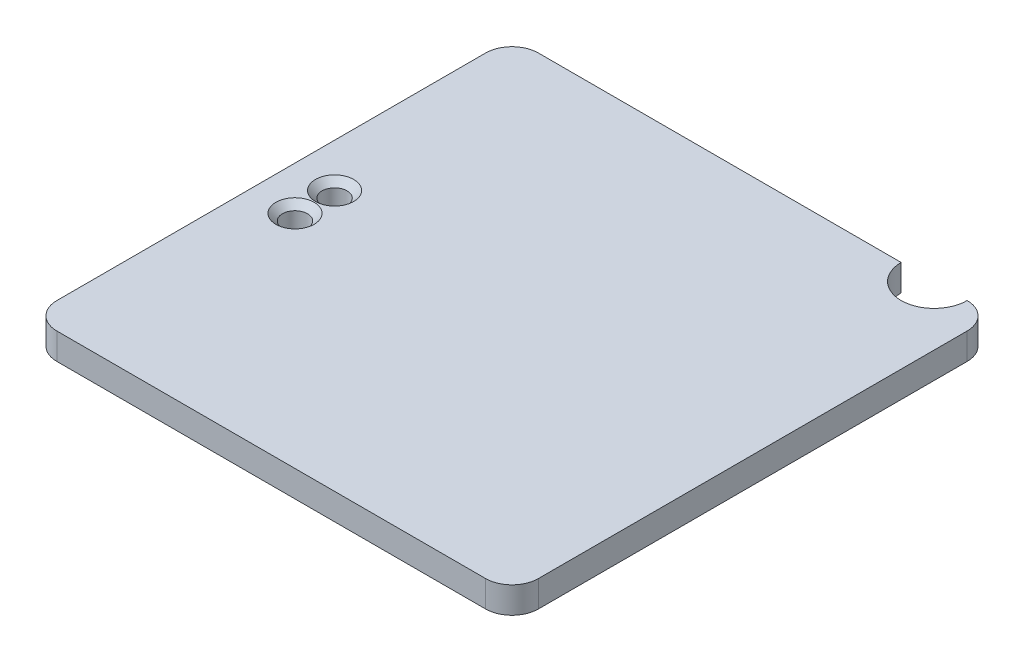
ISO-10303-21;
HEADER;
FILE_DESCRIPTION(('STEP AP214'),'2;1');
FILE_NAME('part.step','',(''),(''),'','','');
FILE_SCHEMA(('AUTOMOTIVE_DESIGN { 1 0 10303 214 1 1 1 1 }'));
ENDSEC;
DATA;
#1=APPLICATION_CONTEXT('core data for automotive mechanical design processes');
#2=APPLICATION_PROTOCOL_DEFINITION('international standard','automotive_design',2000,#1);
#3=PRODUCT_CONTEXT('',#1,'mechanical');
#4=PRODUCT('Part','Part','',(#3));
#5=PRODUCT_RELATED_PRODUCT_CATEGORY('part','',(#4));
#6=PRODUCT_DEFINITION_FORMATION('','',#4);
#7=PRODUCT_DEFINITION_CONTEXT('part definition',#1,'design');
#8=PRODUCT_DEFINITION('design','',#6,#7);
#9=PRODUCT_DEFINITION_SHAPE('','',#8);
#10=(LENGTH_UNIT() NAMED_UNIT(*) SI_UNIT(.MILLI.,.METRE.));
#11=(NAMED_UNIT(*) PLANE_ANGLE_UNIT() SI_UNIT($,.RADIAN.));
#12=(NAMED_UNIT(*) SI_UNIT($,.STERADIAN.) SOLID_ANGLE_UNIT());
#13=UNCERTAINTY_MEASURE_WITH_UNIT(LENGTH_MEASURE(1.E-05),#10,'distance_accuracy_value','');
#14=(GEOMETRIC_REPRESENTATION_CONTEXT(3) GLOBAL_UNCERTAINTY_ASSIGNED_CONTEXT((#13)) GLOBAL_UNIT_ASSIGNED_CONTEXT((#10,
#11,#12)) REPRESENTATION_CONTEXT('',''));
#15=CARTESIAN_POINT('',(0.,0.,0.));
#16=DIRECTION('',(0.,0.,1.));
#17=DIRECTION('',(1.,0.,0.));
#18=AXIS2_PLACEMENT_3D('',#15,#16,#17);
#19=CARTESIAN_POINT('',(0.,7.,-36.5));
#20=DIRECTION('',(0.,0.,-1.));
#21=DIRECTION('',(-1.,0.,0.));
#22=AXIS2_PLACEMENT_3D('',#19,#20,#21);
#23=PLANE('',#22);
#24=DIRECTION('',(1.,0.,0.));
#25=VECTOR('',#24,1.);
#26=CARTESIAN_POINT('',(0.,3.,-36.5));
#27=LINE('',#26,#25);
#28=CARTESIAN_POINT('',(-32.5,3.,-36.5));
#29=VERTEX_POINT('',#28);
#30=CARTESIAN_POINT('',(22.5,3.,-36.5));
#31=VERTEX_POINT('',#30);
#32=EDGE_CURVE('E241',#29,#31,#27,.T.);
#33=ORIENTED_EDGE('',*,*,#32,.F.);
#34=DIRECTION('',(0.,-1.,0.));
#35=VECTOR('',#34,1.);
#36=CARTESIAN_POINT('',(-32.5,7.,-36.5));
#37=LINE('',#36,#35);
#38=CARTESIAN_POINT('',(-32.5,7.,-36.5));
#39=VERTEX_POINT('',#38);
#40=EDGE_CURVE('E286',#39,#29,#37,.T.);
#41=ORIENTED_EDGE('',*,*,#40,.F.);
#42=DIRECTION('',(1.,0.,0.));
#43=VECTOR('',#42,1.);
#44=CARTESIAN_POINT('',(0.,7.,-36.5));
#45=LINE('',#44,#43);
#46=CARTESIAN_POINT('',(22.5,7.,-36.5));
#47=VERTEX_POINT('',#46);
#48=EDGE_CURVE('E260',#39,#47,#45,.T.);
#49=ORIENTED_EDGE('',*,*,#48,.T.);
#50=DIRECTION('',(0.,1.,0.));
#51=VECTOR('',#50,1.);
#52=CARTESIAN_POINT('',(22.5,-7.,-36.5));
#53=LINE('',#52,#51);
#54=EDGE_CURVE('E225',#31,#47,#53,.T.);
#55=ORIENTED_EDGE('',*,*,#54,.F.);
#56=EDGE_LOOP('',(#33,#41,#49,#55));
#57=FACE_BOUND('',#56,.T.);
#58=ADVANCED_FACE('F47',(#57),#23,.T.);
#59=CARTESIAN_POINT('',(0.,7.,36.5));
#60=DIRECTION('',(0.,0.,-1.));
#61=DIRECTION('',(-1.,0.,0.));
#62=AXIS2_PLACEMENT_3D('',#59,#60,#61);
#63=PLANE('',#62);
#64=DIRECTION('',(0.,-1.,0.));
#65=VECTOR('',#64,1.);
#66=CARTESIAN_POINT('',(-32.5,7.,36.5));
#67=LINE('',#66,#65);
#68=CARTESIAN_POINT('',(-32.5,7.,36.5));
#69=VERTEX_POINT('',#68);
#70=CARTESIAN_POINT('',(-32.5,3.,36.5));
#71=VERTEX_POINT('',#70);
#72=EDGE_CURVE('E277',#69,#71,#67,.T.);
#73=ORIENTED_EDGE('',*,*,#72,.T.);
#74=DIRECTION('',(-1.,0.,0.));
#75=VECTOR('',#74,1.);
#76=CARTESIAN_POINT('',(0.,3.,36.5));
#77=LINE('',#76,#75);
#78=CARTESIAN_POINT('',(32.5,3.,36.5));
#79=VERTEX_POINT('',#78);
#80=EDGE_CURVE('E250',#79,#71,#77,.T.);
#81=ORIENTED_EDGE('',*,*,#80,.F.);
#82=DIRECTION('',(0.,-1.,0.));
#83=VECTOR('',#82,1.);
#84=CARTESIAN_POINT('',(32.5,7.,36.5));
#85=LINE('',#84,#83);
#86=CARTESIAN_POINT('',(32.5,7.,36.5));
#87=VERTEX_POINT('',#86);
#88=EDGE_CURVE('E274',#87,#79,#85,.T.);
#89=ORIENTED_EDGE('',*,*,#88,.F.);
#90=DIRECTION('',(1.,0.,0.));
#91=VECTOR('',#90,1.);
#92=CARTESIAN_POINT('',(0.,7.,36.5));
#93=LINE('',#92,#91);
#94=EDGE_CURVE('E272',#69,#87,#93,.T.);
#95=ORIENTED_EDGE('',*,*,#94,.F.);
#96=EDGE_LOOP('',(#73,#81,#89,#95));
#97=FACE_BOUND('',#96,.T.);
#98=ADVANCED_FACE('F331',(#97),#63,.F.);
#99=CARTESIAN_POINT('',(-32.5,7.,-32.5));
#100=DIRECTION('',(0.,-1.,0.));
#101=DIRECTION('',(0.,0.,-1.));
#102=AXIS2_PLACEMENT_3D('',#99,#100,#101);
#103=CYLINDRICAL_SURFACE('',#102,4.);
#104=ORIENTED_EDGE('',*,*,#40,.T.);
#105=CARTESIAN_POINT('',(-32.5,3.,-32.5));
#106=DIRECTION('',(0.,-1.,0.));
#107=DIRECTION('',(0.,0.,-1.));
#108=AXIS2_PLACEMENT_3D('',#105,#106,#107);
#109=CIRCLE('',#108,4.);
#110=CARTESIAN_POINT('',(-36.5,3.,-32.5));
#111=VERTEX_POINT('',#110);
#112=EDGE_CURVE('E208',#29,#111,#109,.F.);
#113=ORIENTED_EDGE('',*,*,#112,.T.);
#114=DIRECTION('',(0.,-1.,0.));
#115=VECTOR('',#114,1.);
#116=CARTESIAN_POINT('',(-36.5,7.,-32.5));
#117=LINE('',#116,#115);
#118=CARTESIAN_POINT('',(-36.5,7.,-32.5));
#119=VERTEX_POINT('',#118);
#120=EDGE_CURVE('E283',#119,#111,#117,.T.);
#121=ORIENTED_EDGE('',*,*,#120,.F.);
#122=CARTESIAN_POINT('',(-32.5,7.,-32.5));
#123=DIRECTION('',(0.,1.,0.));
#124=DIRECTION('',(0.,0.,1.));
#125=AXIS2_PLACEMENT_3D('',#122,#123,#124);
#126=CIRCLE('',#125,4.);
#127=EDGE_CURVE('E263',#119,#39,#126,.F.);
#128=ORIENTED_EDGE('',*,*,#127,.T.);
#129=EDGE_LOOP('',(#104,#113,#121,#128));
#130=FACE_BOUND('',#129,.T.);
#131=ADVANCED_FACE('F338',(#130),#103,.T.);
#132=CARTESIAN_POINT('',(-36.5,7.,0.));
#133=DIRECTION('',(-1.,0.,0.));
#134=DIRECTION('',(0.,0.,1.));
#135=AXIS2_PLACEMENT_3D('',#132,#133,#134);
#136=PLANE('',#135);
#137=ORIENTED_EDGE('',*,*,#120,.T.);
#138=DIRECTION('',(0.,0.,1.));
#139=VECTOR('',#138,1.);
#140=CARTESIAN_POINT('',(-36.5,3.,32.5));
#141=LINE('',#140,#139);
#142=CARTESIAN_POINT('',(-36.5,3.,32.5));
#143=VERTEX_POINT('',#142);
#144=EDGE_CURVE('E205',#111,#143,#141,.T.);
#145=ORIENTED_EDGE('',*,*,#144,.T.);
#146=DIRECTION('',(0.,-1.,0.));
#147=VECTOR('',#146,1.);
#148=CARTESIAN_POINT('',(-36.5,7.,32.5));
#149=LINE('',#148,#147);
#150=CARTESIAN_POINT('',(-36.5,7.,32.5));
#151=VERTEX_POINT('',#150);
#152=EDGE_CURVE('E280',#151,#143,#149,.T.);
#153=ORIENTED_EDGE('',*,*,#152,.F.);
#154=DIRECTION('',(0.,0.,-1.));
#155=VECTOR('',#154,1.);
#156=CARTESIAN_POINT('',(-36.5,7.,0.));
#157=LINE('',#156,#155);
#158=EDGE_CURVE('E266',#151,#119,#157,.T.);
#159=ORIENTED_EDGE('',*,*,#158,.T.);
#160=EDGE_LOOP('',(#137,#145,#153,#159));
#161=FACE_BOUND('',#160,.T.);
#162=ADVANCED_FACE('F382',(#161),#136,.T.);
#163=CARTESIAN_POINT('',(-32.5,7.,32.5));
#164=DIRECTION('',(0.,-1.,0.));
#165=DIRECTION('',(0.,0.,-1.));
#166=AXIS2_PLACEMENT_3D('',#163,#164,#165);
#167=CYLINDRICAL_SURFACE('',#166,4.);
#168=ORIENTED_EDGE('',*,*,#152,.T.);
#169=CARTESIAN_POINT('',(-32.5,3.,32.5));
#170=DIRECTION('',(0.,-1.,0.));
#171=DIRECTION('',(0.,0.,-1.));
#172=AXIS2_PLACEMENT_3D('',#169,#170,#171);
#173=CIRCLE('',#172,4.);
#174=EDGE_CURVE('E201',#143,#71,#173,.F.);
#175=ORIENTED_EDGE('',*,*,#174,.T.);
#176=ORIENTED_EDGE('',*,*,#72,.F.);
#177=CARTESIAN_POINT('',(-32.5,7.,32.5));
#178=DIRECTION('',(0.,1.,0.));
#179=DIRECTION('',(0.,0.,1.));
#180=AXIS2_PLACEMENT_3D('',#177,#178,#179);
#181=CIRCLE('',#180,4.);
#182=EDGE_CURVE('E269',#69,#151,#181,.F.);
#183=ORIENTED_EDGE('',*,*,#182,.T.);
#184=EDGE_LOOP('',(#168,#175,#176,#183));
#185=FACE_BOUND('',#184,.T.);
#186=ADVANCED_FACE('F380',(#185),#167,.T.);
#187=CARTESIAN_POINT('',(-26.4,3.,0.));
#188=DIRECTION('',(-1.,0.,0.));
#189=DIRECTION('',(0.,0.,1.));
#190=AXIS2_PLACEMENT_3D('',#187,#188,#189);
#191=PLANE('',#190);
#192=DIRECTION('',(0.,0.,-1.));
#193=VECTOR('',#192,1.);
#194=CARTESIAN_POINT('',(-26.4,3.,0.));
#195=LINE('',#194,#193);
#196=CARTESIAN_POINT('',(-26.4,3.,7.5));
#197=VERTEX_POINT('',#196);
#198=CARTESIAN_POINT('',(-26.4,3.,-7.50000000000001));
#199=VERTEX_POINT('',#198);
#200=EDGE_CURVE('E239',#197,#199,#195,.T.);
#201=ORIENTED_EDGE('',*,*,#200,.F.);
#202=DIRECTION('',(0.,-1.,0.));
#203=VECTOR('',#202,1.);
#204=CARTESIAN_POINT('',(-26.4,3.,7.5));
#205=LINE('',#204,#203);
#206=CARTESIAN_POINT('',(-26.4,-3.,7.5));
#207=VERTEX_POINT('',#206);
#208=EDGE_CURVE('E218',#197,#207,#205,.T.);
#209=ORIENTED_EDGE('',*,*,#208,.T.);
#210=DIRECTION('',(0.,0.,-1.));
#211=VECTOR('',#210,1.);
#212=CARTESIAN_POINT('',(-26.4,-3.,0.));
#213=LINE('',#212,#211);
#214=CARTESIAN_POINT('',(-26.4,-3.,-6.05));
#215=VERTEX_POINT('',#214);
#216=EDGE_CURVE('E173',#207,#215,#213,.T.);
#217=ORIENTED_EDGE('',*,*,#216,.T.);
#218=DIRECTION('',(0.,1.,0.));
#219=VECTOR('',#218,1.);
#220=CARTESIAN_POINT('',(-26.4,-11.2465509037058,-6.05));
#221=LINE('',#220,#219);
#222=CARTESIAN_POINT('',(-26.4,-4.,-6.05));
#223=VERTEX_POINT('',#222);
#224=EDGE_CURVE('E186',#223,#215,#221,.T.);
#225=ORIENTED_EDGE('',*,*,#224,.F.);
#226=DIRECTION('',(0.,0.,1.));
#227=VECTOR('',#226,1.);
#228=CARTESIAN_POINT('',(-26.4,-4.,0.));
#229=LINE('',#228,#227);
#230=CARTESIAN_POINT('',(-26.4,-4.,-7.50000000000001));
#231=VERTEX_POINT('',#230);
#232=EDGE_CURVE('E167',#231,#223,#229,.T.);
#233=ORIENTED_EDGE('',*,*,#232,.F.);
#234=DIRECTION('',(0.,-1.,0.));
#235=VECTOR('',#234,1.);
#236=CARTESIAN_POINT('',(-26.4,3.,-7.50000000000001));
#237=LINE('',#236,#235);
#238=EDGE_CURVE('E176',#199,#231,#237,.T.);
#239=ORIENTED_EDGE('',*,*,#238,.F.);
#240=EDGE_LOOP('',(#201,#209,#217,#225,#233,#239));
#241=FACE_BOUND('',#240,.T.);
#242=ADVANCED_FACE('F184',(#241),#191,.F.);
#243=CARTESIAN_POINT('',(0.,-3.,0.));
#244=DIRECTION('',(0.,-1.,0.));
#245=DIRECTION('',(0.,0.,-1.));
#246=AXIS2_PLACEMENT_3D('',#243,#244,#245);
#247=PLANE('',#246);
#248=DIRECTION('',(1.,0.,0.));
#249=VECTOR('',#248,1.);
#250=CARTESIAN_POINT('',(0.,-3.,-6.05));
#251=LINE('',#250,#249);
#252=CARTESIAN_POINT('',(-33.5,-3.,-6.05));
#253=VERTEX_POINT('',#252);
#254=EDGE_CURVE('E63',#253,#215,#251,.T.);
#255=ORIENTED_EDGE('',*,*,#254,.T.);
#256=ORIENTED_EDGE('',*,*,#216,.F.);
#257=DIRECTION('',(1.,0.,0.));
#258=VECTOR('',#257,1.);
#259=CARTESIAN_POINT('',(0.,-3.,7.5));
#260=LINE('',#259,#258);
#261=CARTESIAN_POINT('',(-33.5,-3.,7.5));
#262=VERTEX_POINT('',#261);
#263=EDGE_CURVE('E182',#262,#207,#260,.T.);
#264=ORIENTED_EDGE('',*,*,#263,.F.);
#265=DIRECTION('',(0.,0.,1.));
#266=VECTOR('',#265,1.);
#267=CARTESIAN_POINT('',(-33.5,-3.,0.));
#268=LINE('',#267,#266);
#269=EDGE_CURVE('E233',#253,#262,#268,.T.);
#270=ORIENTED_EDGE('',*,*,#269,.F.);
#271=EDGE_LOOP('',(#255,#256,#264,#270));
#272=FACE_BOUND('',#271,.T.);
#273=CARTESIAN_POINT('',(-29.9,-3.,3.));
#274=DIRECTION('',(0.,-1.,0.));
#275=DIRECTION('',(0.,0.,-1.));
#276=AXIS2_PLACEMENT_3D('',#273,#274,#275);
#277=CIRCLE('',#276,1.9);
#278=CARTESIAN_POINT('',(-29.9,-3.,1.1));
#279=VERTEX_POINT('',#278);
#280=EDGE_CURVE('E235',#279,#279,#277,.F.);
#281=ORIENTED_EDGE('',*,*,#280,.T.);
#282=EDGE_LOOP('',(#281));
#283=FACE_BOUND('',#282,.T.);
#284=CARTESIAN_POINT('',(-29.9,-3.,-3.));
#285=DIRECTION('',(0.,-1.,0.));
#286=DIRECTION('',(0.,0.,-1.));
#287=AXIS2_PLACEMENT_3D('',#284,#285,#286);
#288=CIRCLE('',#287,1.9);
#289=CARTESIAN_POINT('',(-29.9,-3.,-4.9));
#290=VERTEX_POINT('',#289);
#291=EDGE_CURVE('E236',#290,#290,#288,.F.);
#292=ORIENTED_EDGE('',*,*,#291,.T.);
#293=EDGE_LOOP('',(#292));
#294=FACE_BOUND('',#293,.T.);
#295=ADVANCED_FACE('F310',(#272,#283,#294),#247,.T.);
#296=CARTESIAN_POINT('',(-29.9,7.,-3.));
#297=DIRECTION('',(0.,-1.,0.));
#298=DIRECTION('',(0.,0.,-1.));
#299=AXIS2_PLACEMENT_3D('',#296,#297,#298);
#300=CYLINDRICAL_SURFACE('',#299,1.9);
#301=CARTESIAN_POINT('',(-29.9,5.99999999999999,-3.));
#302=DIRECTION('',(0.,1.,0.));
#303=DIRECTION('',(0.,0.,1.));
#304=AXIS2_PLACEMENT_3D('',#301,#302,#303);
#305=CIRCLE('',#304,1.9);
#306=CARTESIAN_POINT('',(-29.9,5.99999999999999,-1.1));
#307=VERTEX_POINT('',#306);
#308=EDGE_CURVE('E56',#307,#307,#305,.T.);
#309=ORIENTED_EDGE('',*,*,#308,.T.);
#310=EDGE_LOOP('',(#309));
#311=FACE_BOUND('',#310,.T.);
#312=ORIENTED_EDGE('',*,*,#291,.F.);
#313=EDGE_LOOP('',(#312));
#314=FACE_BOUND('',#313,.T.);
#315=ADVANCED_FACE('F316',(#311,#314),#300,.F.);
#316=CARTESIAN_POINT('',(-29.9,7.,3.));
#317=DIRECTION('',(0.,-1.,0.));
#318=DIRECTION('',(0.,0.,-1.));
#319=AXIS2_PLACEMENT_3D('',#316,#317,#318);
#320=CYLINDRICAL_SURFACE('',#319,1.9);
#321=CARTESIAN_POINT('',(-29.9,5.99999999999999,3.));
#322=DIRECTION('',(0.,1.,0.));
#323=DIRECTION('',(0.,0.,1.));
#324=AXIS2_PLACEMENT_3D('',#321,#322,#323);
#325=CIRCLE('',#324,1.9);
#326=CARTESIAN_POINT('',(-29.9,5.99999999999999,4.9));
#327=VERTEX_POINT('',#326);
#328=EDGE_CURVE('E303',#327,#327,#325,.T.);
#329=ORIENTED_EDGE('',*,*,#328,.T.);
#330=EDGE_LOOP('',(#329));
#331=FACE_BOUND('',#330,.T.);
#332=ORIENTED_EDGE('',*,*,#280,.F.);
#333=EDGE_LOOP('',(#332));
#334=FACE_BOUND('',#333,.T.);
#335=ADVANCED_FACE('F313',(#331,#334),#320,.F.);
#336=CARTESIAN_POINT('',(32.5,7.,32.5));
#337=DIRECTION('',(0.,-1.,0.));
#338=DIRECTION('',(0.,0.,-1.));
#339=AXIS2_PLACEMENT_3D('',#336,#337,#338);
#340=CYLINDRICAL_SURFACE('',#339,4.);
#341=CARTESIAN_POINT('',(32.5,3.,32.5));
#342=DIRECTION('',(0.,-1.,0.));
#343=DIRECTION('',(0.,0.,-1.));
#344=AXIS2_PLACEMENT_3D('',#341,#342,#343);
#345=CIRCLE('',#344,4.);
#346=CARTESIAN_POINT('',(36.5,3.,32.5));
#347=VERTEX_POINT('',#346);
#348=EDGE_CURVE('E248',#347,#79,#345,.T.);
#349=ORIENTED_EDGE('',*,*,#348,.F.);
#350=DIRECTION('',(0.,-1.,0.));
#351=VECTOR('',#350,1.);
#352=CARTESIAN_POINT('',(36.5,7.,32.5));
#353=LINE('',#352,#351);
#354=CARTESIAN_POINT('',(36.5,7.,32.5));
#355=VERTEX_POINT('',#354);
#356=EDGE_CURVE('E294',#355,#347,#353,.T.);
#357=ORIENTED_EDGE('',*,*,#356,.F.);
#358=CARTESIAN_POINT('',(32.5,7.,32.5));
#359=DIRECTION('',(0.,1.,0.));
#360=DIRECTION('',(0.,0.,1.));
#361=AXIS2_PLACEMENT_3D('',#358,#359,#360);
#362=CIRCLE('',#361,4.);
#363=EDGE_CURVE('E252',#87,#355,#362,.T.);
#364=ORIENTED_EDGE('',*,*,#363,.F.);
#365=ORIENTED_EDGE('',*,*,#88,.T.);
#366=EDGE_LOOP('',(#349,#357,#364,#365));
#367=FACE_BOUND('',#366,.T.);
#368=ADVANCED_FACE('F315',(#367),#340,.T.);
#369=CARTESIAN_POINT('',(36.5,7.,0.));
#370=DIRECTION('',(-1.,0.,0.));
#371=DIRECTION('',(0.,0.,1.));
#372=AXIS2_PLACEMENT_3D('',#369,#370,#371);
#373=PLANE('',#372);
#374=DIRECTION('',(0.,0.,1.));
#375=VECTOR('',#374,1.);
#376=CARTESIAN_POINT('',(36.5,3.,0.));
#377=LINE('',#376,#375);
#378=CARTESIAN_POINT('',(36.5,3.,-32.5));
#379=VERTEX_POINT('',#378);
#380=EDGE_CURVE('E246',#379,#347,#377,.T.);
#381=ORIENTED_EDGE('',*,*,#380,.F.);
#382=DIRECTION('',(0.,-1.,0.));
#383=VECTOR('',#382,1.);
#384=CARTESIAN_POINT('',(36.5,7.,-32.5));
#385=LINE('',#384,#383);
#386=CARTESIAN_POINT('',(36.5,7.,-32.5));
#387=VERTEX_POINT('',#386);
#388=EDGE_CURVE('E291',#387,#379,#385,.T.);
#389=ORIENTED_EDGE('',*,*,#388,.F.);
#390=DIRECTION('',(0.,0.,-1.));
#391=VECTOR('',#390,1.);
#392=CARTESIAN_POINT('',(36.5,7.,0.));
#393=LINE('',#392,#391);
#394=EDGE_CURVE('E255',#355,#387,#393,.T.);
#395=ORIENTED_EDGE('',*,*,#394,.F.);
#396=ORIENTED_EDGE('',*,*,#356,.T.);
#397=EDGE_LOOP('',(#381,#389,#395,#396));
#398=FACE_BOUND('',#397,.T.);
#399=ADVANCED_FACE('F324',(#398),#373,.F.);
#400=CARTESIAN_POINT('',(32.5,7.,-32.5));
#401=DIRECTION('',(0.,-1.,0.));
#402=DIRECTION('',(0.,0.,-1.));
#403=AXIS2_PLACEMENT_3D('',#400,#401,#402);
#404=CYLINDRICAL_SURFACE('',#403,4.);
#405=ORIENTED_EDGE('',*,*,#388,.T.);
#406=CARTESIAN_POINT('',(32.5,3.,-32.5));
#407=DIRECTION('',(0.,-1.,0.));
#408=DIRECTION('',(0.,0.,-1.));
#409=AXIS2_PLACEMENT_3D('',#406,#407,#408);
#410=CIRCLE('',#409,4.);
#411=CARTESIAN_POINT('',(32.5,3.,-36.5));
#412=VERTEX_POINT('',#411);
#413=EDGE_CURVE('E244',#412,#379,#410,.T.);
#414=ORIENTED_EDGE('',*,*,#413,.F.);
#415=DIRECTION('',(0.,-1.,0.));
#416=VECTOR('',#415,1.);
#417=CARTESIAN_POINT('',(32.5,7.,-36.5));
#418=LINE('',#417,#416);
#419=CARTESIAN_POINT('',(32.5,7.,-36.5));
#420=VERTEX_POINT('',#419);
#421=EDGE_CURVE('E289',#420,#412,#418,.T.);
#422=ORIENTED_EDGE('',*,*,#421,.F.);
#423=CARTESIAN_POINT('',(32.5,7.,-32.5));
#424=DIRECTION('',(0.,1.,0.));
#425=DIRECTION('',(0.,0.,1.));
#426=AXIS2_PLACEMENT_3D('',#423,#424,#425);
#427=CIRCLE('',#426,4.);
#428=EDGE_CURVE('E257',#420,#387,#427,.F.);
#429=ORIENTED_EDGE('',*,*,#428,.T.);
#430=EDGE_LOOP('',(#405,#414,#422,#429));
#431=FACE_BOUND('',#430,.T.);
#432=ADVANCED_FACE('F344',(#431),#404,.T.);
#433=CARTESIAN_POINT('',(0.,7.,0.));
#434=DIRECTION('',(0.,1.,0.));
#435=DIRECTION('',(0.,0.,1.));
#436=AXIS2_PLACEMENT_3D('',#433,#434,#435);
#437=PLANE('',#436);
#438=CARTESIAN_POINT('',(27.5,7.,-36.5));
#439=DIRECTION('',(0.,1.,0.));
#440=DIRECTION('',(0.,0.,1.));
#441=AXIS2_PLACEMENT_3D('',#438,#439,#440);
#442=CIRCLE('',#441,5.);
#443=EDGE_CURVE('E222',#47,#420,#442,.T.);
#444=ORIENTED_EDGE('',*,*,#443,.F.);
#445=ORIENTED_EDGE('',*,*,#48,.F.);
#446=ORIENTED_EDGE('',*,*,#127,.F.);
#447=ORIENTED_EDGE('',*,*,#158,.F.);
#448=ORIENTED_EDGE('',*,*,#182,.F.);
#449=ORIENTED_EDGE('',*,*,#94,.T.);
#450=ORIENTED_EDGE('',*,*,#363,.T.);
#451=ORIENTED_EDGE('',*,*,#394,.T.);
#452=ORIENTED_EDGE('',*,*,#428,.F.);
#453=EDGE_LOOP('',(#444,#445,#446,#447,#448,#449,#450,#451,#452));
#454=FACE_BOUND('',#453,.T.);
#455=CARTESIAN_POINT('',(-29.9,7.,3.));
#456=DIRECTION('',(0.,1.,0.));
#457=DIRECTION('',(0.,0.,1.));
#458=AXIS2_PLACEMENT_3D('',#455,#456,#457);
#459=CIRCLE('',#458,2.90000000000001);
#460=CARTESIAN_POINT('',(-29.9,7.,5.90000000000001));
#461=VERTEX_POINT('',#460);
#462=EDGE_CURVE('E300',#461,#461,#459,.F.);
#463=ORIENTED_EDGE('',*,*,#462,.T.);
#464=EDGE_LOOP('',(#463));
#465=FACE_BOUND('',#464,.T.);
#466=CARTESIAN_POINT('',(-29.9,7.,-3.));
#467=DIRECTION('',(0.,1.,0.));
#468=DIRECTION('',(0.,0.,1.));
#469=AXIS2_PLACEMENT_3D('',#466,#467,#468);
#470=CIRCLE('',#469,2.90000000000001);
#471=CARTESIAN_POINT('',(-29.9,7.,-0.0999999999999864));
#472=VERTEX_POINT('',#471);
#473=EDGE_CURVE('E297',#472,#472,#470,.F.);
#474=ORIENTED_EDGE('',*,*,#473,.T.);
#475=EDGE_LOOP('',(#474));
#476=FACE_BOUND('',#475,.T.);
#477=ADVANCED_FACE('F346',(#454,#465,#476),#437,.T.);
#478=CARTESIAN_POINT('',(0.,3.,0.));
#479=DIRECTION('',(0.,-1.,0.));
#480=DIRECTION('',(0.,0.,-1.));
#481=AXIS2_PLACEMENT_3D('',#478,#479,#480);
#482=PLANE('',#481);
#483=ORIENTED_EDGE('',*,*,#80,.T.);
#484=ORIENTED_EDGE('',*,*,#174,.F.);
#485=ORIENTED_EDGE('',*,*,#144,.F.);
#486=ORIENTED_EDGE('',*,*,#112,.F.);
#487=ORIENTED_EDGE('',*,*,#32,.T.);
#488=CARTESIAN_POINT('',(27.5,3.,-36.5));
#489=DIRECTION('',(0.,-1.,0.));
#490=DIRECTION('',(0.,0.,-1.));
#491=AXIS2_PLACEMENT_3D('',#488,#489,#490);
#492=CIRCLE('',#491,5.);
#493=EDGE_CURVE('E12',#412,#31,#492,.T.);
#494=ORIENTED_EDGE('',*,*,#493,.F.);
#495=ORIENTED_EDGE('',*,*,#413,.T.);
#496=ORIENTED_EDGE('',*,*,#380,.T.);
#497=ORIENTED_EDGE('',*,*,#348,.T.);
#498=EDGE_LOOP('',(#483,#484,#485,#486,#487,#494,#495,#496,#497));
#499=FACE_BOUND('',#498,.T.);
#500=DIRECTION('',(0.,0.,-1.));
#501=VECTOR('',#500,1.);
#502=CARTESIAN_POINT('',(-35.5,3.,-7.5));
#503=LINE('',#502,#501);
#504=CARTESIAN_POINT('',(-35.5,3.,7.5));
#505=VERTEX_POINT('',#504);
#506=CARTESIAN_POINT('',(-35.5,3.,-7.5));
#507=VERTEX_POINT('',#506);
#508=EDGE_CURVE('E198',#505,#507,#503,.T.);
#509=ORIENTED_EDGE('',*,*,#508,.F.);
#510=DIRECTION('',(1.,0.,0.));
#511=VECTOR('',#510,1.);
#512=CARTESIAN_POINT('',(0.,3.,7.5));
#513=LINE('',#512,#511);
#514=EDGE_CURVE('E215',#505,#197,#513,.T.);
#515=ORIENTED_EDGE('',*,*,#514,.T.);
#516=ORIENTED_EDGE('',*,*,#200,.T.);
#517=DIRECTION('',(1.,0.,0.));
#518=VECTOR('',#517,1.);
#519=CARTESIAN_POINT('',(0.,3.,-7.50000000000001));
#520=LINE('',#519,#518);
#521=EDGE_CURVE('E178',#507,#199,#520,.T.);
#522=ORIENTED_EDGE('',*,*,#521,.F.);
#523=EDGE_LOOP('',(#509,#515,#516,#522));
#524=FACE_BOUND('',#523,.T.);
#525=ADVANCED_FACE('F355',(#499,#524),#482,.T.);
#526=CARTESIAN_POINT('',(-29.9,7.,3.));
#527=DIRECTION('',(0.,1.,0.));
#528=DIRECTION('',(0.,0.,1.));
#529=AXIS2_PLACEMENT_3D('',#526,#527,#528);
#530=CONICAL_SURFACE('',#529,2.90000000000001,0.785398163397452);
#531=ORIENTED_EDGE('',*,*,#328,.F.);
#532=EDGE_LOOP('',(#531));
#533=FACE_BOUND('',#532,.T.);
#534=ORIENTED_EDGE('',*,*,#462,.F.);
#535=EDGE_LOOP('',(#534));
#536=FACE_BOUND('',#535,.T.);
#537=ADVANCED_FACE('F351',(#533,#536),#530,.F.);
#538=CARTESIAN_POINT('',(-29.9,7.,-3.));
#539=DIRECTION('',(0.,1.,0.));
#540=DIRECTION('',(0.,0.,1.));
#541=AXIS2_PLACEMENT_3D('',#538,#539,#540);
#542=CONICAL_SURFACE('',#541,2.90000000000001,0.785398163397452);
#543=ORIENTED_EDGE('',*,*,#308,.F.);
#544=EDGE_LOOP('',(#543));
#545=FACE_BOUND('',#544,.T.);
#546=ORIENTED_EDGE('',*,*,#473,.F.);
#547=EDGE_LOOP('',(#546));
#548=FACE_BOUND('',#547,.T.);
#549=ADVANCED_FACE('F50',(#545,#548),#542,.F.);
#550=CARTESIAN_POINT('',(-33.5,-3.,0.));
#551=DIRECTION('',(1.,0.,0.));
#552=DIRECTION('',(0.,0.,-1.));
#553=AXIS2_PLACEMENT_3D('',#550,#551,#552);
#554=PLANE('',#553);
#555=DIRECTION('',(0.,1.,0.));
#556=VECTOR('',#555,1.);
#557=CARTESIAN_POINT('',(-33.5,-11.2465509037058,-6.05));
#558=LINE('',#557,#556);
#559=CARTESIAN_POINT('',(-33.5,-4.,-6.05));
#560=VERTEX_POINT('',#559);
#561=EDGE_CURVE('E71',#560,#253,#558,.T.);
#562=ORIENTED_EDGE('',*,*,#561,.T.);
#563=ORIENTED_EDGE('',*,*,#269,.T.);
#564=DIRECTION('',(0.,-1.,0.));
#565=VECTOR('',#564,1.);
#566=CARTESIAN_POINT('',(-33.5,94.4002188181188,7.5));
#567=LINE('',#566,#565);
#568=CARTESIAN_POINT('',(-33.5,-3.99999999999998,7.5));
#569=VERTEX_POINT('',#568);
#570=EDGE_CURVE('E202',#262,#569,#567,.T.);
#571=ORIENTED_EDGE('',*,*,#570,.T.);
#572=DIRECTION('',(0.,0.,-1.));
#573=VECTOR('',#572,1.);
#574=CARTESIAN_POINT('',(-33.5,-4.,0.));
#575=LINE('',#574,#573);
#576=EDGE_CURVE('E227',#569,#560,#575,.T.);
#577=ORIENTED_EDGE('',*,*,#576,.T.);
#578=EDGE_LOOP('',(#562,#563,#571,#577));
#579=FACE_BOUND('',#578,.T.);
#580=ADVANCED_FACE('F360',(#579),#554,.T.);
#581=CARTESIAN_POINT('',(0.,-4.,0.));
#582=DIRECTION('',(0.,-1.,0.));
#583=DIRECTION('',(0.,0.,-1.));
#584=AXIS2_PLACEMENT_3D('',#581,#582,#583);
#585=PLANE('',#584);
#586=ORIENTED_EDGE('',*,*,#576,.F.);
#587=DIRECTION('',(-1.,0.,0.));
#588=VECTOR('',#587,1.);
#589=CARTESIAN_POINT('',(0.,-4.,7.5));
#590=LINE('',#589,#588);
#591=CARTESIAN_POINT('',(-35.5,-3.99999999999998,7.5));
#592=VERTEX_POINT('',#591);
#593=EDGE_CURVE('E229',#569,#592,#590,.T.);
#594=ORIENTED_EDGE('',*,*,#593,.T.);
#595=DIRECTION('',(0.,0.,-1.));
#596=VECTOR('',#595,1.);
#597=CARTESIAN_POINT('',(-35.5,-4.,0.));
#598=LINE('',#597,#596);
#599=CARTESIAN_POINT('',(-35.5,-3.99999999999998,-7.5));
#600=VERTEX_POINT('',#599);
#601=EDGE_CURVE('E169',#592,#600,#598,.T.);
#602=ORIENTED_EDGE('',*,*,#601,.T.);
#603=DIRECTION('',(1.,0.,0.));
#604=VECTOR('',#603,1.);
#605=CARTESIAN_POINT('',(0.,-4.,-7.5));
#606=LINE('',#605,#604);
#607=EDGE_CURVE('E161',#600,#231,#606,.T.);
#608=ORIENTED_EDGE('',*,*,#607,.T.);
#609=ORIENTED_EDGE('',*,*,#232,.T.);
#610=DIRECTION('',(1.,0.,0.));
#611=VECTOR('',#610,1.);
#612=CARTESIAN_POINT('',(0.,-4.,-6.05));
#613=LINE('',#612,#611);
#614=EDGE_CURVE('E195',#560,#223,#613,.T.);
#615=ORIENTED_EDGE('',*,*,#614,.F.);
#616=EDGE_LOOP('',(#586,#594,#602,#608,#609,#615));
#617=FACE_BOUND('',#616,.T.);
#618=ADVANCED_FACE('F164',(#617),#585,.T.);
#619=CARTESIAN_POINT('',(27.5,-7.,-36.5));
#620=DIRECTION('',(0.,1.,0.));
#621=DIRECTION('',(0.,0.,1.));
#622=AXIS2_PLACEMENT_3D('',#619,#620,#621);
#623=CYLINDRICAL_SURFACE('',#622,5.);
#624=ORIENTED_EDGE('',*,*,#493,.T.);
#625=ORIENTED_EDGE('',*,*,#54,.T.);
#626=ORIENTED_EDGE('',*,*,#443,.T.);
#627=ORIENTED_EDGE('',*,*,#421,.T.);
#628=EDGE_LOOP('',(#624,#625,#626,#627));
#629=FACE_BOUND('',#628,.T.);
#630=ADVANCED_FACE('F410',(#629),#623,.F.);
#631=CARTESIAN_POINT('',(0.,3.,-7.50000000000001));
#632=DIRECTION('',(0.,0.,-1.));
#633=DIRECTION('',(-1.,0.,0.));
#634=AXIS2_PLACEMENT_3D('',#631,#632,#633);
#635=PLANE('',#634);
#636=ORIENTED_EDGE('',*,*,#238,.T.);
#637=ORIENTED_EDGE('',*,*,#607,.F.);
#638=DIRECTION('',(0.,-1.,0.));
#639=VECTOR('',#638,1.);
#640=CARTESIAN_POINT('',(-35.5,94.4002188181188,-7.5));
#641=LINE('',#640,#639);
#642=EDGE_CURVE('E188',#507,#600,#641,.T.);
#643=ORIENTED_EDGE('',*,*,#642,.F.);
#644=ORIENTED_EDGE('',*,*,#521,.T.);
#645=EDGE_LOOP('',(#636,#637,#643,#644));
#646=FACE_BOUND('',#645,.T.);
#647=ADVANCED_FACE('F177',(#646),#635,.T.);
#648=CARTESIAN_POINT('',(0.,3.,7.5));
#649=DIRECTION('',(0.,0.,-1.));
#650=DIRECTION('',(-1.,0.,0.));
#651=AXIS2_PLACEMENT_3D('',#648,#649,#650);
#652=PLANE('',#651);
#653=ORIENTED_EDGE('',*,*,#263,.T.);
#654=ORIENTED_EDGE('',*,*,#208,.F.);
#655=ORIENTED_EDGE('',*,*,#514,.F.);
#656=DIRECTION('',(0.,-1.,0.));
#657=VECTOR('',#656,1.);
#658=CARTESIAN_POINT('',(-35.5,94.4002188181188,7.5));
#659=LINE('',#658,#657);
#660=EDGE_CURVE('E190',#505,#592,#659,.T.);
#661=ORIENTED_EDGE('',*,*,#660,.T.);
#662=ORIENTED_EDGE('',*,*,#593,.F.);
#663=ORIENTED_EDGE('',*,*,#570,.F.);
#664=EDGE_LOOP('',(#653,#654,#655,#661,#662,#663));
#665=FACE_BOUND('',#664,.T.);
#666=ADVANCED_FACE('F415',(#665),#652,.F.);
#667=CARTESIAN_POINT('',(-35.5,94.4002188181188,-7.5));
#668=DIRECTION('',(1.,0.,0.));
#669=DIRECTION('',(0.,0.,-1.));
#670=AXIS2_PLACEMENT_3D('',#667,#668,#669);
#671=PLANE('',#670);
#672=ORIENTED_EDGE('',*,*,#601,.F.);
#673=ORIENTED_EDGE('',*,*,#660,.F.);
#674=ORIENTED_EDGE('',*,*,#508,.T.);
#675=ORIENTED_EDGE('',*,*,#642,.T.);
#676=EDGE_LOOP('',(#672,#673,#674,#675));
#677=FACE_BOUND('',#676,.T.);
#678=ADVANCED_FACE('F447',(#677),#671,.F.);
#679=CARTESIAN_POINT('',(0.,-11.2465509037058,-6.05));
#680=DIRECTION('',(0.,0.,1.));
#681=DIRECTION('',(1.,0.,0.));
#682=AXIS2_PLACEMENT_3D('',#679,#680,#681);
#683=PLANE('',#682);
#684=ORIENTED_EDGE('',*,*,#561,.F.);
#685=ORIENTED_EDGE('',*,*,#614,.T.);
#686=ORIENTED_EDGE('',*,*,#224,.T.);
#687=ORIENTED_EDGE('',*,*,#254,.F.);
#688=EDGE_LOOP('',(#684,#685,#686,#687));
#689=FACE_BOUND('',#688,.T.);
#690=ADVANCED_FACE('F445',(#689),#683,.T.);
#691=CLOSED_SHELL('',(#58,#98,#131,#162,#186,#242,#295,#315,#335,#368,#399,#432,#477,#525,#537,
#549,#580,#618,#630,#647,#666,#678,#690));
#692=MANIFOLD_SOLID_BREP('B2',#691);
#693=ADVANCED_BREP_SHAPE_REPRESENTATION('',(#18,#692),#14);
#694=SHAPE_DEFINITION_REPRESENTATION(#9,#693);
ENDSEC;
END-ISO-10303-21;
